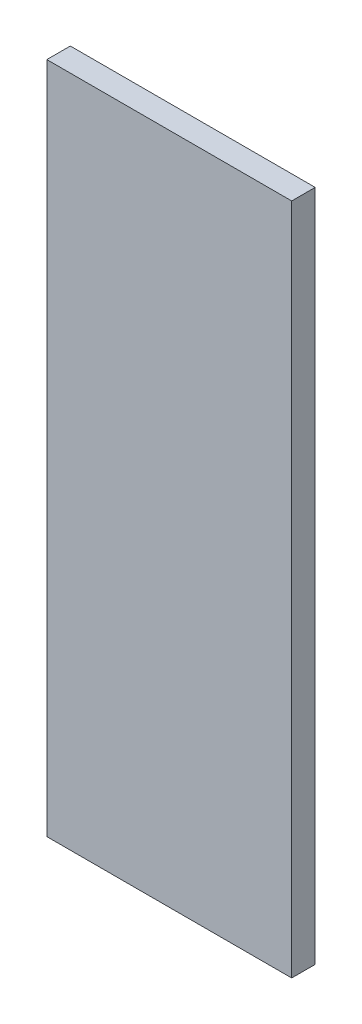
ISO-10303-21;
HEADER;
FILE_DESCRIPTION(('STEP AP214'),'2;1');
FILE_NAME('part.step','',(''),(''),'','','');
FILE_SCHEMA(('AUTOMOTIVE_DESIGN { 1 0 10303 214 1 1 1 1 }'));
ENDSEC;
DATA;
#1=APPLICATION_CONTEXT('core data for automotive mechanical design processes');
#2=APPLICATION_PROTOCOL_DEFINITION('international standard','automotive_design',2000,#1);
#3=PRODUCT_CONTEXT('',#1,'mechanical');
#4=PRODUCT('Part','Part','',(#3));
#5=PRODUCT_RELATED_PRODUCT_CATEGORY('part','',(#4));
#6=PRODUCT_DEFINITION_FORMATION('','',#4);
#7=PRODUCT_DEFINITION_CONTEXT('part definition',#1,'design');
#8=PRODUCT_DEFINITION('design','',#6,#7);
#9=PRODUCT_DEFINITION_SHAPE('','',#8);
#10=(LENGTH_UNIT() NAMED_UNIT(*) SI_UNIT(.MILLI.,.METRE.));
#11=(NAMED_UNIT(*) PLANE_ANGLE_UNIT() SI_UNIT($,.RADIAN.));
#12=(NAMED_UNIT(*) SI_UNIT($,.STERADIAN.) SOLID_ANGLE_UNIT());
#13=UNCERTAINTY_MEASURE_WITH_UNIT(LENGTH_MEASURE(1.E-05),#10,'distance_accuracy_value','');
#14=(GEOMETRIC_REPRESENTATION_CONTEXT(3) GLOBAL_UNCERTAINTY_ASSIGNED_CONTEXT((#13)) GLOBAL_UNIT_ASSIGNED_CONTEXT((#10,
#11,#12)) REPRESENTATION_CONTEXT('',''));
#15=CARTESIAN_POINT('',(0.,0.,0.));
#16=DIRECTION('',(0.,0.,1.));
#17=DIRECTION('',(1.,0.,0.));
#18=AXIS2_PLACEMENT_3D('',#15,#16,#17);
#19=CARTESIAN_POINT('',(0.52377418298775,-0.636643661734989,0.));
#20=DIRECTION('',(0.,1.,0.));
#21=DIRECTION('',(-1.,0.,0.));
#22=AXIS2_PLACEMENT_3D('',#19,#20,#21);
#23=PLANE('',#22);
#24=DIRECTION('',(-1.,0.,0.));
#25=VECTOR('',#24,1.);
#26=CARTESIAN_POINT('',(0.52377418298775,-0.636643661734989,0.));
#27=LINE('',#26,#25);
#28=CARTESIAN_POINT('',(0.52377418298775,-0.636643661734989,0.));
#29=VERTEX_POINT('',#28);
#30=CARTESIAN_POINT('',(0.49250811985747,-0.636643661734989,0.));
#31=VERTEX_POINT('',#30);
#32=EDGE_CURVE('E11',#29,#31,#27,.T.);
#33=ORIENTED_EDGE('',*,*,#32,.T.);
#34=DIRECTION('',(0.,0.,1.));
#35=VECTOR('',#34,1.);
#36=CARTESIAN_POINT('',(0.49250811985747,-0.636643661734989,0.));
#37=LINE('',#36,#35);
#38=CARTESIAN_POINT('',(0.49250811985747,-0.636643661734989,0.003));
#39=VERTEX_POINT('',#38);
#40=EDGE_CURVE('E24',#31,#39,#37,.T.);
#41=ORIENTED_EDGE('',*,*,#40,.T.);
#42=DIRECTION('',(-1.,0.,0.));
#43=VECTOR('',#42,1.);
#44=CARTESIAN_POINT('',(0.52377418298775,-0.636643661734989,0.003));
#45=LINE('',#44,#43);
#46=CARTESIAN_POINT('',(0.52377418298775,-0.636643661734989,0.003));
#47=VERTEX_POINT('',#46);
#48=EDGE_CURVE('E75',#47,#39,#45,.T.);
#49=ORIENTED_EDGE('',*,*,#48,.F.);
#50=DIRECTION('',(0.,0.,1.));
#51=VECTOR('',#50,1.);
#52=CARTESIAN_POINT('',(0.52377418298775,-0.636643661734989,0.));
#53=LINE('',#52,#51);
#54=EDGE_CURVE('E86',#29,#47,#53,.T.);
#55=ORIENTED_EDGE('',*,*,#54,.F.);
#56=EDGE_LOOP('',(#33,#41,#49,#55));
#57=FACE_BOUND('',#56,.T.);
#58=ADVANCED_FACE('F17',(#57),#23,.T.);
#59=CARTESIAN_POINT('',(0.52377418298775,-0.722568280483534,0.));
#60=DIRECTION('',(1.,0.,0.));
#61=DIRECTION('',(0.,1.,0.));
#62=AXIS2_PLACEMENT_3D('',#59,#60,#61);
#63=PLANE('',#62);
#64=DIRECTION('',(0.,1.,0.));
#65=VECTOR('',#64,1.);
#66=CARTESIAN_POINT('',(0.52377418298775,-0.722568280483534,0.));
#67=LINE('',#66,#65);
#68=CARTESIAN_POINT('',(0.52377418298775,-0.722568280483534,0.));
#69=VERTEX_POINT('',#68);
#70=EDGE_CURVE('E83',#69,#29,#67,.T.);
#71=ORIENTED_EDGE('',*,*,#70,.T.);
#72=ORIENTED_EDGE('',*,*,#54,.T.);
#73=DIRECTION('',(0.,1.,0.));
#74=VECTOR('',#73,1.);
#75=CARTESIAN_POINT('',(0.52377418298775,-0.722568280483534,0.003));
#76=LINE('',#75,#74);
#77=CARTESIAN_POINT('',(0.52377418298775,-0.722568280483534,0.003));
#78=VERTEX_POINT('',#77);
#79=EDGE_CURVE('E81',#78,#47,#76,.T.);
#80=ORIENTED_EDGE('',*,*,#79,.F.);
#81=DIRECTION('',(0.,0.,1.));
#82=VECTOR('',#81,1.);
#83=CARTESIAN_POINT('',(0.52377418298775,-0.722568280483534,0.));
#84=LINE('',#83,#82);
#85=EDGE_CURVE('E61',#69,#78,#84,.T.);
#86=ORIENTED_EDGE('',*,*,#85,.F.);
#87=EDGE_LOOP('',(#71,#72,#80,#86));
#88=FACE_BOUND('',#87,.T.);
#89=ADVANCED_FACE('F91',(#88),#63,.T.);
#90=CARTESIAN_POINT('',(0.49250811985747,-0.722568280483534,0.));
#91=DIRECTION('',(0.,-1.,0.));
#92=DIRECTION('',(1.,0.,0.));
#93=AXIS2_PLACEMENT_3D('',#90,#91,#92);
#94=PLANE('',#93);
#95=DIRECTION('',(1.,0.,0.));
#96=VECTOR('',#95,1.);
#97=CARTESIAN_POINT('',(0.49250811985747,-0.722568280483534,0.));
#98=LINE('',#97,#96);
#99=CARTESIAN_POINT('',(0.49250811985747,-0.722568280483534,0.));
#100=VERTEX_POINT('',#99);
#101=EDGE_CURVE('E65',#100,#69,#98,.T.);
#102=ORIENTED_EDGE('',*,*,#101,.T.);
#103=ORIENTED_EDGE('',*,*,#85,.T.);
#104=DIRECTION('',(1.,0.,0.));
#105=VECTOR('',#104,1.);
#106=CARTESIAN_POINT('',(0.49250811985747,-0.722568280483534,0.003));
#107=LINE('',#106,#105);
#108=CARTESIAN_POINT('',(0.49250811985747,-0.722568280483534,0.003));
#109=VERTEX_POINT('',#108);
#110=EDGE_CURVE('E54',#109,#78,#107,.T.);
#111=ORIENTED_EDGE('',*,*,#110,.F.);
#112=DIRECTION('',(0.,0.,1.));
#113=VECTOR('',#112,1.);
#114=CARTESIAN_POINT('',(0.49250811985747,-0.722568280483534,0.));
#115=LINE('',#114,#113);
#116=EDGE_CURVE('E58',#100,#109,#115,.T.);
#117=ORIENTED_EDGE('',*,*,#116,.F.);
#118=EDGE_LOOP('',(#102,#103,#111,#117));
#119=FACE_BOUND('',#118,.T.);
#120=ADVANCED_FACE('F57',(#119),#94,.T.);
#121=CARTESIAN_POINT('',(0.49250811985747,-0.636643661734989,0.));
#122=DIRECTION('',(-1.,0.,0.));
#123=DIRECTION('',(0.,-1.,0.));
#124=AXIS2_PLACEMENT_3D('',#121,#122,#123);
#125=PLANE('',#124);
#126=DIRECTION('',(0.,-1.,0.));
#127=VECTOR('',#126,1.);
#128=CARTESIAN_POINT('',(0.49250811985747,-0.636643661734989,0.));
#129=LINE('',#128,#127);
#130=EDGE_CURVE('E71',#31,#100,#129,.T.);
#131=ORIENTED_EDGE('',*,*,#130,.T.);
#132=ORIENTED_EDGE('',*,*,#116,.T.);
#133=DIRECTION('',(0.,-1.,0.));
#134=VECTOR('',#133,1.);
#135=CARTESIAN_POINT('',(0.49250811985747,-0.636643661734989,0.003));
#136=LINE('',#135,#134);
#137=EDGE_CURVE('E70',#39,#109,#136,.T.);
#138=ORIENTED_EDGE('',*,*,#137,.F.);
#139=ORIENTED_EDGE('',*,*,#40,.F.);
#140=EDGE_LOOP('',(#131,#132,#138,#139));
#141=FACE_BOUND('',#140,.T.);
#142=ADVANCED_FACE('F69',(#141),#125,.T.);
#143=CARTESIAN_POINT('',(0.50814115142261,-0.679605971109262,0.003));
#144=DIRECTION('',(0.,0.,1.));
#145=DIRECTION('',(1.,0.,0.));
#146=AXIS2_PLACEMENT_3D('',#143,#144,#145);
#147=PLANE('',#146);
#148=ORIENTED_EDGE('',*,*,#137,.T.);
#149=ORIENTED_EDGE('',*,*,#110,.T.);
#150=ORIENTED_EDGE('',*,*,#79,.T.);
#151=ORIENTED_EDGE('',*,*,#48,.T.);
#152=EDGE_LOOP('',(#148,#149,#150,#151));
#153=FACE_BOUND('',#152,.T.);
#154=ADVANCED_FACE('F74',(#153),#147,.T.);
#155=CARTESIAN_POINT('',(0.50814115142261,-0.679605971109262,0.));
#156=DIRECTION('',(0.,0.,1.));
#157=DIRECTION('',(1.,0.,0.));
#158=AXIS2_PLACEMENT_3D('',#155,#156,#157);
#159=PLANE('',#158);
#160=ORIENTED_EDGE('',*,*,#130,.F.);
#161=ORIENTED_EDGE('',*,*,#32,.F.);
#162=ORIENTED_EDGE('',*,*,#70,.F.);
#163=ORIENTED_EDGE('',*,*,#101,.F.);
#164=EDGE_LOOP('',(#160,#161,#162,#163));
#165=FACE_BOUND('',#164,.T.);
#166=ADVANCED_FACE('F89',(#165),#159,.F.);
#167=CLOSED_SHELL('',(#58,#89,#120,#142,#154,#166));
#168=MANIFOLD_SOLID_BREP('B1',#167);
#169=ADVANCED_BREP_SHAPE_REPRESENTATION('',(#18,#168),#14);
#170=SHAPE_DEFINITION_REPRESENTATION(#9,#169);
ENDSEC;
END-ISO-10303-21;
